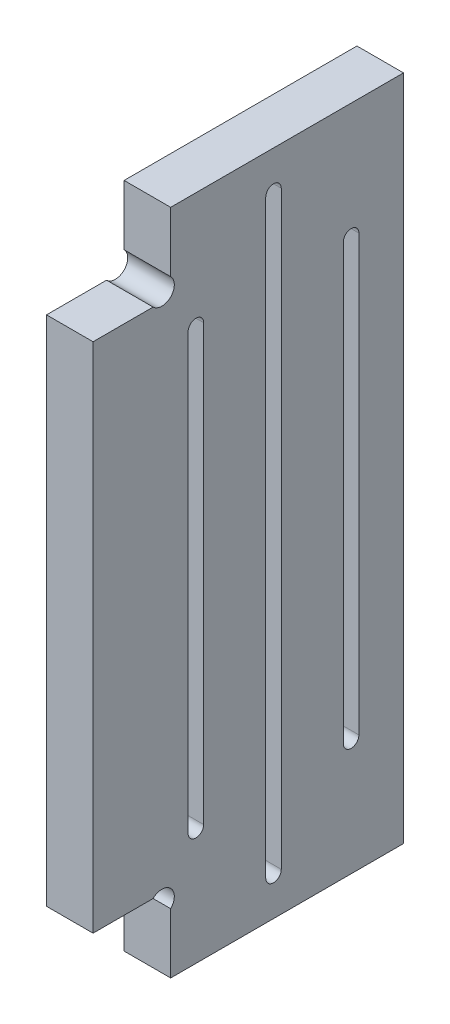
ISO-10303-21;
HEADER;
FILE_DESCRIPTION(('STEP AP214'),'2;1');
FILE_NAME('part.step','',(''),(''),'','','');
FILE_SCHEMA(('AUTOMOTIVE_DESIGN { 1 0 10303 214 1 1 1 1 }'));
ENDSEC;
DATA;
#1=APPLICATION_CONTEXT('core data for automotive mechanical design processes');
#2=APPLICATION_PROTOCOL_DEFINITION('international standard','automotive_design',2000,#1);
#3=PRODUCT_CONTEXT('',#1,'mechanical');
#4=PRODUCT('Part','Part','',(#3));
#5=PRODUCT_RELATED_PRODUCT_CATEGORY('part','',(#4));
#6=PRODUCT_DEFINITION_FORMATION('','',#4);
#7=PRODUCT_DEFINITION_CONTEXT('part definition',#1,'design');
#8=PRODUCT_DEFINITION('design','',#6,#7);
#9=PRODUCT_DEFINITION_SHAPE('','',#8);
#10=(LENGTH_UNIT() NAMED_UNIT(*) SI_UNIT(.MILLI.,.METRE.));
#11=(NAMED_UNIT(*) PLANE_ANGLE_UNIT() SI_UNIT($,.RADIAN.));
#12=(NAMED_UNIT(*) SI_UNIT($,.STERADIAN.) SOLID_ANGLE_UNIT());
#13=UNCERTAINTY_MEASURE_WITH_UNIT(LENGTH_MEASURE(1.E-05),#10,'distance_accuracy_value','');
#14=(GEOMETRIC_REPRESENTATION_CONTEXT(3) GLOBAL_UNCERTAINTY_ASSIGNED_CONTEXT((#13)) GLOBAL_UNIT_ASSIGNED_CONTEXT((#10,
#11,#12)) REPRESENTATION_CONTEXT('',''));
#15=CARTESIAN_POINT('',(0.,0.,0.));
#16=DIRECTION('',(0.,0.,1.));
#17=DIRECTION('',(1.,0.,0.));
#18=AXIS2_PLACEMENT_3D('',#15,#16,#17);
#19=CARTESIAN_POINT('',(6.,219.125569004844,-80.));
#20=DIRECTION('',(0.,0.,-1.));
#21=DIRECTION('',(-1.,0.,0.));
#22=AXIS2_PLACEMENT_3D('',#19,#20,#21);
#23=PLANE('',#22);
#24=DIRECTION('',(0.,-1.,0.));
#25=VECTOR('',#24,1.);
#26=CARTESIAN_POINT('',(0.,219.125569004844,-80.));
#27=LINE('',#26,#25);
#28=CARTESIAN_POINT('',(0.,226.862827305047,-80.));
#29=VERTEX_POINT('',#28);
#30=CARTESIAN_POINT('',(0.,219.125569004844,-80.));
#31=VERTEX_POINT('',#30);
#32=EDGE_CURVE('E218',#29,#31,#27,.T.);
#33=ORIENTED_EDGE('',*,*,#32,.T.);
#34=DIRECTION('',(-1.,0.,0.));
#35=VECTOR('',#34,1.);
#36=CARTESIAN_POINT('',(6.,219.125569004844,-80.));
#37=LINE('',#36,#35);
#38=CARTESIAN_POINT('',(6.,219.125569004844,-80.));
#39=VERTEX_POINT('',#38);
#40=EDGE_CURVE('E11',#39,#31,#37,.T.);
#41=ORIENTED_EDGE('',*,*,#40,.F.);
#42=DIRECTION('',(0.,-1.,0.));
#43=VECTOR('',#42,1.);
#44=CARTESIAN_POINT('',(6.,219.125569004844,-80.));
#45=LINE('',#44,#43);
#46=CARTESIAN_POINT('',(6.,226.862827305047,-80.));
#47=VERTEX_POINT('',#46);
#48=EDGE_CURVE('E283',#47,#39,#45,.T.);
#49=ORIENTED_EDGE('',*,*,#48,.F.);
#50=DIRECTION('',(-1.,0.,0.));
#51=VECTOR('',#50,1.);
#52=CARTESIAN_POINT('',(6.,226.862827305047,-80.));
#53=LINE('',#52,#51);
#54=EDGE_CURVE('E305',#47,#29,#53,.T.);
#55=ORIENTED_EDGE('',*,*,#54,.T.);
#56=EDGE_LOOP('',(#33,#41,#49,#55));
#57=FACE_BOUND('',#56,.T.);
#58=ADVANCED_FACE('F32',(#57),#23,.F.);
#59=CARTESIAN_POINT('',(6.,217.994198154946,-78.8686291501015));
#60=DIRECTION('',(-1.,0.,0.));
#61=DIRECTION('',(0.,0.,1.));
#62=AXIS2_PLACEMENT_3D('',#59,#60,#61);
#63=CYLINDRICAL_SURFACE('',#62,1.6);
#64=CARTESIAN_POINT('',(0.,217.994198154946,-78.8686291501015));
#65=DIRECTION('',(-1.,0.,0.));
#66=DIRECTION('',(0.,0.,1.));
#67=AXIS2_PLACEMENT_3D('',#64,#65,#66);
#68=CIRCLE('',#67,1.6);
#69=CARTESIAN_POINT('',(0.,216.862827305047,-77.737258300203));
#70=VERTEX_POINT('',#69);
#71=EDGE_CURVE('E308',#31,#70,#68,.T.);
#72=ORIENTED_EDGE('',*,*,#71,.T.);
#73=DIRECTION('',(-1.,0.,0.));
#74=VECTOR('',#73,1.);
#75=CARTESIAN_POINT('',(6.,216.862827305047,-77.737258300203));
#76=LINE('',#75,#74);
#77=CARTESIAN_POINT('',(6.,216.862827305047,-77.737258300203));
#78=VERTEX_POINT('',#77);
#79=EDGE_CURVE('E39',#78,#70,#76,.T.);
#80=ORIENTED_EDGE('',*,*,#79,.F.);
#81=CARTESIAN_POINT('',(6.,217.994198154946,-78.8686291501015));
#82=DIRECTION('',(-1.,0.,0.));
#83=DIRECTION('',(0.,0.,1.));
#84=AXIS2_PLACEMENT_3D('',#81,#82,#83);
#85=CIRCLE('',#84,1.6);
#86=EDGE_CURVE('E286',#39,#78,#85,.T.);
#87=ORIENTED_EDGE('',*,*,#86,.F.);
#88=ORIENTED_EDGE('',*,*,#40,.T.);
#89=EDGE_LOOP('',(#72,#80,#87,#88));
#90=FACE_BOUND('',#89,.T.);
#91=ADVANCED_FACE('F374',(#90),#63,.F.);
#92=CARTESIAN_POINT('',(6.,216.862827305047,-77.737258300203));
#93=DIRECTION('',(0.,-1.,0.));
#94=DIRECTION('',(0.,0.,-1.));
#95=AXIS2_PLACEMENT_3D('',#92,#93,#94);
#96=PLANE('',#95);
#97=DIRECTION('',(0.,0.,1.));
#98=VECTOR('',#97,1.);
#99=CARTESIAN_POINT('',(0.,216.862827305047,-77.737258300203));
#100=LINE('',#99,#98);
#101=CARTESIAN_POINT('',(0.,216.862827305047,-70.));
#102=VERTEX_POINT('',#101);
#103=EDGE_CURVE('E310',#70,#102,#100,.T.);
#104=ORIENTED_EDGE('',*,*,#103,.T.);
#105=DIRECTION('',(-1.,0.,0.));
#106=VECTOR('',#105,1.);
#107=CARTESIAN_POINT('',(6.,216.862827305047,-70.));
#108=LINE('',#107,#106);
#109=CARTESIAN_POINT('',(6.,216.862827305047,-70.));
#110=VERTEX_POINT('',#109);
#111=EDGE_CURVE('E345',#110,#102,#108,.T.);
#112=ORIENTED_EDGE('',*,*,#111,.F.);
#113=DIRECTION('',(0.,0.,1.));
#114=VECTOR('',#113,1.);
#115=CARTESIAN_POINT('',(6.,216.862827305047,-77.737258300203));
#116=LINE('',#115,#114);
#117=EDGE_CURVE('E289',#78,#110,#116,.T.);
#118=ORIENTED_EDGE('',*,*,#117,.F.);
#119=ORIENTED_EDGE('',*,*,#79,.T.);
#120=EDGE_LOOP('',(#104,#112,#118,#119));
#121=FACE_BOUND('',#120,.T.);
#122=ADVANCED_FACE('F352',(#121),#96,.F.);
#123=CARTESIAN_POINT('',(6.,150.862827305047,-70.));
#124=DIRECTION('',(0.,0.,-1.));
#125=DIRECTION('',(-1.,0.,0.));
#126=AXIS2_PLACEMENT_3D('',#123,#124,#125);
#127=PLANE('',#126);
#128=DIRECTION('',(0.,-1.,0.));
#129=VECTOR('',#128,1.);
#130=CARTESIAN_POINT('',(0.,150.862827305047,-70.));
#131=LINE('',#130,#129);
#132=CARTESIAN_POINT('',(0.,150.862827305047,-70.));
#133=VERTEX_POINT('',#132);
#134=EDGE_CURVE('E312',#102,#133,#131,.T.);
#135=ORIENTED_EDGE('',*,*,#134,.T.);
#136=DIRECTION('',(-1.,0.,0.));
#137=VECTOR('',#136,1.);
#138=CARTESIAN_POINT('',(6.,150.862827305047,-70.));
#139=LINE('',#138,#137);
#140=CARTESIAN_POINT('',(6.,150.862827305047,-70.));
#141=VERTEX_POINT('',#140);
#142=EDGE_CURVE('E342',#141,#133,#139,.T.);
#143=ORIENTED_EDGE('',*,*,#142,.F.);
#144=DIRECTION('',(0.,-1.,0.));
#145=VECTOR('',#144,1.);
#146=CARTESIAN_POINT('',(6.,150.862827305047,-70.));
#147=LINE('',#146,#145);
#148=EDGE_CURVE('E291',#110,#141,#147,.T.);
#149=ORIENTED_EDGE('',*,*,#148,.F.);
#150=ORIENTED_EDGE('',*,*,#111,.T.);
#151=EDGE_LOOP('',(#135,#143,#149,#150));
#152=FACE_BOUND('',#151,.T.);
#153=ADVANCED_FACE('F363',(#152),#127,.F.);
#154=CARTESIAN_POINT('',(6.,150.862827305047,-77.737258300203));
#155=DIRECTION('',(0.,1.,0.));
#156=DIRECTION('',(0.,0.,1.));
#157=AXIS2_PLACEMENT_3D('',#154,#155,#156);
#158=PLANE('',#157);
#159=DIRECTION('',(0.,0.,-1.));
#160=VECTOR('',#159,1.);
#161=CARTESIAN_POINT('',(0.,150.862827305047,-77.737258300203));
#162=LINE('',#161,#160);
#163=CARTESIAN_POINT('',(0.,150.862827305047,-77.737258300203));
#164=VERTEX_POINT('',#163);
#165=EDGE_CURVE('E314',#133,#164,#162,.T.);
#166=ORIENTED_EDGE('',*,*,#165,.T.);
#167=DIRECTION('',(-1.,0.,0.));
#168=VECTOR('',#167,1.);
#169=CARTESIAN_POINT('',(6.,150.862827305047,-77.737258300203));
#170=LINE('',#169,#168);
#171=CARTESIAN_POINT('',(6.,150.862827305047,-77.737258300203));
#172=VERTEX_POINT('',#171);
#173=EDGE_CURVE('E339',#172,#164,#170,.T.);
#174=ORIENTED_EDGE('',*,*,#173,.F.);
#175=DIRECTION('',(0.,0.,-1.));
#176=VECTOR('',#175,1.);
#177=CARTESIAN_POINT('',(6.,150.862827305047,-77.737258300203));
#178=LINE('',#177,#176);
#179=EDGE_CURVE('E293',#141,#172,#178,.T.);
#180=ORIENTED_EDGE('',*,*,#179,.F.);
#181=ORIENTED_EDGE('',*,*,#142,.T.);
#182=EDGE_LOOP('',(#166,#174,#180,#181));
#183=FACE_BOUND('',#182,.T.);
#184=ADVANCED_FACE('F367',(#183),#158,.F.);
#185=CARTESIAN_POINT('',(6.,149.731456455149,-78.8686291501015));
#186=DIRECTION('',(-1.,0.,0.));
#187=DIRECTION('',(0.,0.,1.));
#188=AXIS2_PLACEMENT_3D('',#185,#186,#187);
#189=CYLINDRICAL_SURFACE('',#188,1.6);
#190=CARTESIAN_POINT('',(0.,149.731456455149,-78.8686291501015));
#191=DIRECTION('',(-1.,0.,0.));
#192=DIRECTION('',(0.,0.,-1.));
#193=AXIS2_PLACEMENT_3D('',#190,#191,#192);
#194=CIRCLE('',#193,1.6);
#195=CARTESIAN_POINT('',(0.,148.60008560525,-80.));
#196=VERTEX_POINT('',#195);
#197=EDGE_CURVE('E316',#164,#196,#194,.T.);
#198=ORIENTED_EDGE('',*,*,#197,.T.);
#199=DIRECTION('',(-1.,0.,0.));
#200=VECTOR('',#199,1.);
#201=CARTESIAN_POINT('',(6.,148.60008560525,-80.));
#202=LINE('',#201,#200);
#203=CARTESIAN_POINT('',(6.,148.60008560525,-80.));
#204=VERTEX_POINT('',#203);
#205=EDGE_CURVE('E336',#204,#196,#202,.T.);
#206=ORIENTED_EDGE('',*,*,#205,.F.);
#207=CARTESIAN_POINT('',(6.,149.731456455149,-78.8686291501015));
#208=DIRECTION('',(-1.,0.,0.));
#209=DIRECTION('',(0.,0.,-1.));
#210=AXIS2_PLACEMENT_3D('',#207,#208,#209);
#211=CIRCLE('',#210,1.6);
#212=EDGE_CURVE('E295',#172,#204,#211,.T.);
#213=ORIENTED_EDGE('',*,*,#212,.F.);
#214=ORIENTED_EDGE('',*,*,#173,.T.);
#215=EDGE_LOOP('',(#198,#206,#213,#214));
#216=FACE_BOUND('',#215,.T.);
#217=ADVANCED_FACE('F397',(#216),#189,.F.);
#218=CARTESIAN_POINT('',(6.,140.862827305047,-80.));
#219=DIRECTION('',(0.,0.,-1.));
#220=DIRECTION('',(0.,1.,0.));
#221=AXIS2_PLACEMENT_3D('',#218,#219,#220);
#222=PLANE('',#221);
#223=DIRECTION('',(0.,-1.,0.));
#224=VECTOR('',#223,1.);
#225=CARTESIAN_POINT('',(0.,140.862827305047,-80.));
#226=LINE('',#225,#224);
#227=CARTESIAN_POINT('',(0.,140.862827305047,-80.));
#228=VERTEX_POINT('',#227);
#229=EDGE_CURVE('E318',#196,#228,#226,.T.);
#230=ORIENTED_EDGE('',*,*,#229,.T.);
#231=DIRECTION('',(-1.,0.,0.));
#232=VECTOR('',#231,1.);
#233=CARTESIAN_POINT('',(6.,140.862827305047,-80.));
#234=LINE('',#233,#232);
#235=CARTESIAN_POINT('',(6.,140.862827305047,-80.));
#236=VERTEX_POINT('',#235);
#237=EDGE_CURVE('E333',#236,#228,#234,.T.);
#238=ORIENTED_EDGE('',*,*,#237,.F.);
#239=DIRECTION('',(0.,-1.,0.));
#240=VECTOR('',#239,1.);
#241=CARTESIAN_POINT('',(6.,140.862827305047,-80.));
#242=LINE('',#241,#240);
#243=EDGE_CURVE('E297',#204,#236,#242,.T.);
#244=ORIENTED_EDGE('',*,*,#243,.F.);
#245=ORIENTED_EDGE('',*,*,#205,.T.);
#246=EDGE_LOOP('',(#230,#238,#244,#245));
#247=FACE_BOUND('',#246,.T.);
#248=ADVANCED_FACE('F394',(#247),#222,.F.);
#249=CARTESIAN_POINT('',(6.,140.862827305047,-80.));
#250=DIRECTION('',(0.,1.,0.));
#251=DIRECTION('',(0.,0.,1.));
#252=AXIS2_PLACEMENT_3D('',#249,#250,#251);
#253=PLANE('',#252);
#254=DIRECTION('',(0.,0.,-1.));
#255=VECTOR('',#254,1.);
#256=CARTESIAN_POINT('',(0.,140.862827305047,-80.));
#257=LINE('',#256,#255);
#258=CARTESIAN_POINT('',(0.,140.862827305047,-110.));
#259=VERTEX_POINT('',#258);
#260=EDGE_CURVE('E320',#228,#259,#257,.T.);
#261=ORIENTED_EDGE('',*,*,#260,.T.);
#262=DIRECTION('',(-1.,0.,0.));
#263=VECTOR('',#262,1.);
#264=CARTESIAN_POINT('',(6.,140.862827305047,-110.));
#265=LINE('',#264,#263);
#266=CARTESIAN_POINT('',(6.,140.862827305047,-110.));
#267=VERTEX_POINT('',#266);
#268=EDGE_CURVE('E330',#267,#259,#265,.T.);
#269=ORIENTED_EDGE('',*,*,#268,.F.);
#270=DIRECTION('',(0.,0.,-1.));
#271=VECTOR('',#270,1.);
#272=CARTESIAN_POINT('',(6.,140.862827305047,-80.));
#273=LINE('',#272,#271);
#274=EDGE_CURVE('E299',#236,#267,#273,.T.);
#275=ORIENTED_EDGE('',*,*,#274,.F.);
#276=ORIENTED_EDGE('',*,*,#237,.T.);
#277=EDGE_LOOP('',(#261,#269,#275,#276));
#278=FACE_BOUND('',#277,.T.);
#279=ADVANCED_FACE('F390',(#278),#253,.F.);
#280=CARTESIAN_POINT('',(6.,140.862827305047,-110.));
#281=DIRECTION('',(0.,0.,1.));
#282=DIRECTION('',(1.,0.,0.));
#283=AXIS2_PLACEMENT_3D('',#280,#281,#282);
#284=PLANE('',#283);
#285=DIRECTION('',(0.,1.,0.));
#286=VECTOR('',#285,1.);
#287=CARTESIAN_POINT('',(0.,140.862827305047,-110.));
#288=LINE('',#287,#286);
#289=CARTESIAN_POINT('',(0.,226.862827305047,-110.));
#290=VERTEX_POINT('',#289);
#291=EDGE_CURVE('E322',#259,#290,#288,.T.);
#292=ORIENTED_EDGE('',*,*,#291,.T.);
#293=DIRECTION('',(-1.,0.,0.));
#294=VECTOR('',#293,1.);
#295=CARTESIAN_POINT('',(6.,226.862827305047,-110.));
#296=LINE('',#295,#294);
#297=CARTESIAN_POINT('',(6.,226.862827305047,-110.));
#298=VERTEX_POINT('',#297);
#299=EDGE_CURVE('E327',#298,#290,#296,.T.);
#300=ORIENTED_EDGE('',*,*,#299,.F.);
#301=DIRECTION('',(0.,1.,0.));
#302=VECTOR('',#301,1.);
#303=CARTESIAN_POINT('',(6.,140.862827305047,-110.));
#304=LINE('',#303,#302);
#305=EDGE_CURVE('E301',#267,#298,#304,.T.);
#306=ORIENTED_EDGE('',*,*,#305,.F.);
#307=ORIENTED_EDGE('',*,*,#268,.T.);
#308=EDGE_LOOP('',(#292,#300,#306,#307));
#309=FACE_BOUND('',#308,.T.);
#310=ADVANCED_FACE('F386',(#309),#284,.F.);
#311=CARTESIAN_POINT('',(6.,226.862827305047,-110.));
#312=DIRECTION('',(0.,-1.,0.));
#313=DIRECTION('',(0.,0.,-1.));
#314=AXIS2_PLACEMENT_3D('',#311,#312,#313);
#315=PLANE('',#314);
#316=DIRECTION('',(0.,0.,1.));
#317=VECTOR('',#316,1.);
#318=CARTESIAN_POINT('',(0.,226.862827305047,-110.));
#319=LINE('',#318,#317);
#320=EDGE_CURVE('E287',#290,#29,#319,.T.);
#321=ORIENTED_EDGE('',*,*,#320,.T.);
#322=ORIENTED_EDGE('',*,*,#54,.F.);
#323=DIRECTION('',(0.,0.,1.));
#324=VECTOR('',#323,1.);
#325=CARTESIAN_POINT('',(6.,226.862827305047,-110.));
#326=LINE('',#325,#324);
#327=EDGE_CURVE('E303',#298,#47,#326,.T.);
#328=ORIENTED_EDGE('',*,*,#327,.F.);
#329=ORIENTED_EDGE('',*,*,#299,.T.);
#330=EDGE_LOOP('',(#321,#322,#328,#329));
#331=FACE_BOUND('',#330,.T.);
#332=ADVANCED_FACE('F381',(#331),#315,.F.);
#333=CARTESIAN_POINT('',(6.,149.731456455149,-78.8686291501015));
#334=DIRECTION('',(1.,0.,0.));
#335=DIRECTION('',(0.,0.,-1.));
#336=AXIS2_PLACEMENT_3D('',#333,#334,#335);
#337=PLANE('',#336);
#338=CARTESIAN_POINT('',(6.,155.862827305047,-83.25));
#339=DIRECTION('',(-1.,0.,0.));
#340=DIRECTION('',(0.,0.,1.));
#341=AXIS2_PLACEMENT_3D('',#338,#339,#340);
#342=CIRCLE('',#341,1.);
#343=CARTESIAN_POINT('',(6.,155.862827305047,-84.25));
#344=VERTEX_POINT('',#343);
#345=CARTESIAN_POINT('',(6.,155.862827305047,-82.25));
#346=VERTEX_POINT('',#345);
#347=EDGE_CURVE('E184',#344,#346,#342,.T.);
#348=ORIENTED_EDGE('',*,*,#347,.T.);
#349=DIRECTION('',(0.,1.,0.));
#350=VECTOR('',#349,1.);
#351=CARTESIAN_POINT('',(6.,155.862827305047,-82.25));
#352=LINE('',#351,#350);
#353=CARTESIAN_POINT('',(6.,211.862827305047,-82.25));
#354=VERTEX_POINT('',#353);
#355=EDGE_CURVE('E195',#346,#354,#352,.T.);
#356=ORIENTED_EDGE('',*,*,#355,.T.);
#357=CARTESIAN_POINT('',(6.,211.862827305047,-83.25));
#358=DIRECTION('',(-1.,0.,0.));
#359=DIRECTION('',(0.,0.,1.));
#360=AXIS2_PLACEMENT_3D('',#357,#358,#359);
#361=CIRCLE('',#360,0.999999999999987);
#362=CARTESIAN_POINT('',(6.,211.862827305047,-84.25));
#363=VERTEX_POINT('',#362);
#364=EDGE_CURVE('E46',#354,#363,#361,.T.);
#365=ORIENTED_EDGE('',*,*,#364,.T.);
#366=DIRECTION('',(0.,-1.,0.));
#367=VECTOR('',#366,1.);
#368=CARTESIAN_POINT('',(6.,155.862827305047,-84.25));
#369=LINE('',#368,#367);
#370=EDGE_CURVE('E192',#363,#344,#369,.T.);
#371=ORIENTED_EDGE('',*,*,#370,.T.);
#372=EDGE_LOOP('',(#348,#356,#365,#371));
#373=FACE_BOUND('',#372,.T.);
#374=CARTESIAN_POINT('',(6.,145.862827305047,-93.25));
#375=DIRECTION('',(-1.,0.,0.));
#376=DIRECTION('',(0.,0.,1.));
#377=AXIS2_PLACEMENT_3D('',#374,#375,#376);
#378=CIRCLE('',#377,1.);
#379=CARTESIAN_POINT('',(6.,145.862827305047,-94.25));
#380=VERTEX_POINT('',#379);
#381=CARTESIAN_POINT('',(6.,145.862827305047,-92.25));
#382=VERTEX_POINT('',#381);
#383=EDGE_CURVE('E222',#380,#382,#378,.T.);
#384=ORIENTED_EDGE('',*,*,#383,.T.);
#385=DIRECTION('',(0.,1.,0.));
#386=VECTOR('',#385,1.);
#387=CARTESIAN_POINT('',(6.,145.862827305047,-92.25));
#388=LINE('',#387,#386);
#389=CARTESIAN_POINT('',(6.,221.862827305047,-92.25));
#390=VERTEX_POINT('',#389);
#391=EDGE_CURVE('E225',#382,#390,#388,.T.);
#392=ORIENTED_EDGE('',*,*,#391,.T.);
#393=CARTESIAN_POINT('',(6.,221.862827305047,-93.25));
#394=DIRECTION('',(-1.,0.,0.));
#395=DIRECTION('',(0.,0.,1.));
#396=AXIS2_PLACEMENT_3D('',#393,#394,#395);
#397=CIRCLE('',#396,1.);
#398=CARTESIAN_POINT('',(6.,221.862827305047,-94.25));
#399=VERTEX_POINT('',#398);
#400=EDGE_CURVE('E54',#390,#399,#397,.T.);
#401=ORIENTED_EDGE('',*,*,#400,.T.);
#402=DIRECTION('',(0.,-1.,0.));
#403=VECTOR('',#402,1.);
#404=CARTESIAN_POINT('',(6.,145.862827305047,-94.25));
#405=LINE('',#404,#403);
#406=EDGE_CURVE('E230',#399,#380,#405,.T.);
#407=ORIENTED_EDGE('',*,*,#406,.T.);
#408=EDGE_LOOP('',(#384,#392,#401,#407));
#409=FACE_BOUND('',#408,.T.);
#410=CARTESIAN_POINT('',(6.,155.862827305047,-103.25));
#411=DIRECTION('',(-1.,0.,0.));
#412=DIRECTION('',(0.,0.,1.));
#413=AXIS2_PLACEMENT_3D('',#410,#411,#412);
#414=CIRCLE('',#413,1.);
#415=CARTESIAN_POINT('',(6.,155.862827305047,-104.25));
#416=VERTEX_POINT('',#415);
#417=CARTESIAN_POINT('',(6.,155.862827305047,-102.25));
#418=VERTEX_POINT('',#417);
#419=EDGE_CURVE('E252',#416,#418,#414,.T.);
#420=ORIENTED_EDGE('',*,*,#419,.T.);
#421=DIRECTION('',(0.,1.,0.));
#422=VECTOR('',#421,1.);
#423=CARTESIAN_POINT('',(6.,155.862827305047,-102.25));
#424=LINE('',#423,#422);
#425=CARTESIAN_POINT('',(6.,211.862827305047,-102.25));
#426=VERTEX_POINT('',#425);
#427=EDGE_CURVE('E255',#418,#426,#424,.T.);
#428=ORIENTED_EDGE('',*,*,#427,.T.);
#429=CARTESIAN_POINT('',(6.,211.862827305047,-103.25));
#430=DIRECTION('',(-1.,0.,0.));
#431=DIRECTION('',(0.,0.,1.));
#432=AXIS2_PLACEMENT_3D('',#429,#430,#431);
#433=CIRCLE('',#432,1.);
#434=CARTESIAN_POINT('',(6.,211.862827305047,-104.25));
#435=VERTEX_POINT('',#434);
#436=EDGE_CURVE('E259',#426,#435,#433,.T.);
#437=ORIENTED_EDGE('',*,*,#436,.T.);
#438=DIRECTION('',(0.,-1.,0.));
#439=VECTOR('',#438,1.);
#440=CARTESIAN_POINT('',(6.,155.862827305047,-104.25));
#441=LINE('',#440,#439);
#442=EDGE_CURVE('E262',#435,#416,#441,.T.);
#443=ORIENTED_EDGE('',*,*,#442,.T.);
#444=EDGE_LOOP('',(#420,#428,#437,#443));
#445=FACE_BOUND('',#444,.T.);
#446=ORIENTED_EDGE('',*,*,#48,.T.);
#447=ORIENTED_EDGE('',*,*,#86,.T.);
#448=ORIENTED_EDGE('',*,*,#117,.T.);
#449=ORIENTED_EDGE('',*,*,#148,.T.);
#450=ORIENTED_EDGE('',*,*,#179,.T.);
#451=ORIENTED_EDGE('',*,*,#212,.T.);
#452=ORIENTED_EDGE('',*,*,#243,.T.);
#453=ORIENTED_EDGE('',*,*,#274,.T.);
#454=ORIENTED_EDGE('',*,*,#305,.T.);
#455=ORIENTED_EDGE('',*,*,#327,.T.);
#456=EDGE_LOOP('',(#446,#447,#448,#449,#450,#451,#452,#453,#454,#455));
#457=FACE_BOUND('',#456,.T.);
#458=ADVANCED_FACE('F199',(#373,#409,#445,#457),#337,.T.);
#459=CARTESIAN_POINT('',(0.,149.731456455149,-78.8686291501015));
#460=DIRECTION('',(1.,0.,0.));
#461=DIRECTION('',(0.,0.,-1.));
#462=AXIS2_PLACEMENT_3D('',#459,#460,#461);
#463=PLANE('',#462);
#464=DIRECTION('',(0.,1.,0.));
#465=VECTOR('',#464,1.);
#466=CARTESIAN_POINT('',(0.,155.862827305047,-82.25));
#467=LINE('',#466,#465);
#468=CARTESIAN_POINT('',(0.,155.862827305047,-82.25));
#469=VERTEX_POINT('',#468);
#470=CARTESIAN_POINT('',(0.,211.862827305047,-82.25));
#471=VERTEX_POINT('',#470);
#472=EDGE_CURVE('E211',#469,#471,#467,.T.);
#473=ORIENTED_EDGE('',*,*,#472,.F.);
#474=CARTESIAN_POINT('',(0.,155.862827305047,-83.25));
#475=DIRECTION('',(-1.,0.,0.));
#476=DIRECTION('',(0.,0.,1.));
#477=AXIS2_PLACEMENT_3D('',#474,#475,#476);
#478=CIRCLE('',#477,1.);
#479=CARTESIAN_POINT('',(0.,155.862827305047,-84.25));
#480=VERTEX_POINT('',#479);
#481=EDGE_CURVE('E187',#480,#469,#478,.T.);
#482=ORIENTED_EDGE('',*,*,#481,.F.);
#483=DIRECTION('',(0.,-1.,0.));
#484=VECTOR('',#483,1.);
#485=CARTESIAN_POINT('',(0.,155.862827305047,-84.25));
#486=LINE('',#485,#484);
#487=CARTESIAN_POINT('',(0.,211.862827305047,-84.25));
#488=VERTEX_POINT('',#487);
#489=EDGE_CURVE('E202',#488,#480,#486,.T.);
#490=ORIENTED_EDGE('',*,*,#489,.F.);
#491=CARTESIAN_POINT('',(0.,211.862827305047,-83.25));
#492=DIRECTION('',(-1.,0.,0.));
#493=DIRECTION('',(0.,0.,1.));
#494=AXIS2_PLACEMENT_3D('',#491,#492,#493);
#495=CIRCLE('',#494,0.999999999999987);
#496=EDGE_CURVE('E205',#471,#488,#495,.T.);
#497=ORIENTED_EDGE('',*,*,#496,.F.);
#498=EDGE_LOOP('',(#473,#482,#490,#497));
#499=FACE_BOUND('',#498,.T.);
#500=DIRECTION('',(0.,1.,0.));
#501=VECTOR('',#500,1.);
#502=CARTESIAN_POINT('',(0.,145.862827305047,-92.25));
#503=LINE('',#502,#501);
#504=CARTESIAN_POINT('',(0.,145.862827305047,-92.25));
#505=VERTEX_POINT('',#504);
#506=CARTESIAN_POINT('',(0.,221.862827305047,-92.25));
#507=VERTEX_POINT('',#506);
#508=EDGE_CURVE('E236',#505,#507,#503,.T.);
#509=ORIENTED_EDGE('',*,*,#508,.F.);
#510=CARTESIAN_POINT('',(0.,145.862827305047,-93.25));
#511=DIRECTION('',(-1.,0.,0.));
#512=DIRECTION('',(0.,0.,1.));
#513=AXIS2_PLACEMENT_3D('',#510,#511,#512);
#514=CIRCLE('',#513,1.);
#515=CARTESIAN_POINT('',(0.,145.862827305047,-94.25));
#516=VERTEX_POINT('',#515);
#517=EDGE_CURVE('E234',#516,#505,#514,.T.);
#518=ORIENTED_EDGE('',*,*,#517,.F.);
#519=DIRECTION('',(0.,-1.,0.));
#520=VECTOR('',#519,1.);
#521=CARTESIAN_POINT('',(0.,145.862827305047,-94.25));
#522=LINE('',#521,#520);
#523=CARTESIAN_POINT('',(0.,221.862827305047,-94.25));
#524=VERTEX_POINT('',#523);
#525=EDGE_CURVE('E226',#524,#516,#522,.T.);
#526=ORIENTED_EDGE('',*,*,#525,.F.);
#527=CARTESIAN_POINT('',(0.,221.862827305047,-93.25));
#528=DIRECTION('',(-1.,0.,0.));
#529=DIRECTION('',(0.,0.,1.));
#530=AXIS2_PLACEMENT_3D('',#527,#528,#529);
#531=CIRCLE('',#530,1.);
#532=EDGE_CURVE('E240',#507,#524,#531,.T.);
#533=ORIENTED_EDGE('',*,*,#532,.F.);
#534=EDGE_LOOP('',(#509,#518,#526,#533));
#535=FACE_BOUND('',#534,.T.);
#536=DIRECTION('',(0.,1.,0.));
#537=VECTOR('',#536,1.);
#538=CARTESIAN_POINT('',(0.,155.862827305047,-102.25));
#539=LINE('',#538,#537);
#540=CARTESIAN_POINT('',(0.,155.862827305047,-102.25));
#541=VERTEX_POINT('',#540);
#542=CARTESIAN_POINT('',(0.,211.862827305047,-102.25));
#543=VERTEX_POINT('',#542);
#544=EDGE_CURVE('E268',#541,#543,#539,.T.);
#545=ORIENTED_EDGE('',*,*,#544,.F.);
#546=CARTESIAN_POINT('',(0.,155.862827305047,-103.25));
#547=DIRECTION('',(-1.,0.,0.));
#548=DIRECTION('',(0.,0.,1.));
#549=AXIS2_PLACEMENT_3D('',#546,#547,#548);
#550=CIRCLE('',#549,1.);
#551=CARTESIAN_POINT('',(0.,155.862827305047,-104.25));
#552=VERTEX_POINT('',#551);
#553=EDGE_CURVE('E266',#552,#541,#550,.T.);
#554=ORIENTED_EDGE('',*,*,#553,.F.);
#555=DIRECTION('',(0.,-1.,0.));
#556=VECTOR('',#555,1.);
#557=CARTESIAN_POINT('',(0.,155.862827305047,-104.25));
#558=LINE('',#557,#556);
#559=CARTESIAN_POINT('',(0.,211.862827305047,-104.25));
#560=VERTEX_POINT('',#559);
#561=EDGE_CURVE('E256',#560,#552,#558,.T.);
#562=ORIENTED_EDGE('',*,*,#561,.F.);
#563=CARTESIAN_POINT('',(0.,211.862827305047,-103.25));
#564=DIRECTION('',(-1.,0.,0.));
#565=DIRECTION('',(0.,0.,1.));
#566=AXIS2_PLACEMENT_3D('',#563,#564,#565);
#567=CIRCLE('',#566,1.);
#568=EDGE_CURVE('E271',#543,#560,#567,.T.);
#569=ORIENTED_EDGE('',*,*,#568,.F.);
#570=EDGE_LOOP('',(#545,#554,#562,#569));
#571=FACE_BOUND('',#570,.T.);
#572=ORIENTED_EDGE('',*,*,#32,.F.);
#573=ORIENTED_EDGE('',*,*,#320,.F.);
#574=ORIENTED_EDGE('',*,*,#291,.F.);
#575=ORIENTED_EDGE('',*,*,#260,.F.);
#576=ORIENTED_EDGE('',*,*,#229,.F.);
#577=ORIENTED_EDGE('',*,*,#197,.F.);
#578=ORIENTED_EDGE('',*,*,#165,.F.);
#579=ORIENTED_EDGE('',*,*,#134,.F.);
#580=ORIENTED_EDGE('',*,*,#103,.F.);
#581=ORIENTED_EDGE('',*,*,#71,.F.);
#582=EDGE_LOOP('',(#572,#573,#574,#575,#576,#577,#578,#579,#580,#581));
#583=FACE_BOUND('',#582,.T.);
#584=ADVANCED_FACE('F358',(#499,#535,#571,#583),#463,.F.);
#585=CARTESIAN_POINT('',(6.,155.862827305047,-103.25));
#586=DIRECTION('',(-1.,0.,0.));
#587=DIRECTION('',(0.,0.,1.));
#588=AXIS2_PLACEMENT_3D('',#585,#586,#587);
#589=CYLINDRICAL_SURFACE('',#588,1.);
#590=ORIENTED_EDGE('',*,*,#553,.T.);
#591=DIRECTION('',(-1.,0.,0.));
#592=VECTOR('',#591,1.);
#593=CARTESIAN_POINT('',(6.,155.862827305047,-102.25));
#594=LINE('',#593,#592);
#595=EDGE_CURVE('E265',#418,#541,#594,.T.);
#596=ORIENTED_EDGE('',*,*,#595,.F.);
#597=ORIENTED_EDGE('',*,*,#419,.F.);
#598=DIRECTION('',(-1.,0.,0.));
#599=VECTOR('',#598,1.);
#600=CARTESIAN_POINT('',(6.,155.862827305047,-104.25));
#601=LINE('',#600,#599);
#602=EDGE_CURVE('E237',#416,#552,#601,.T.);
#603=ORIENTED_EDGE('',*,*,#602,.T.);
#604=EDGE_LOOP('',(#590,#596,#597,#603));
#605=FACE_BOUND('',#604,.T.);
#606=ADVANCED_FACE('F475',(#605),#589,.F.);
#607=CARTESIAN_POINT('',(6.,155.862827305047,-104.25));
#608=DIRECTION('',(0.,0.,-1.));
#609=DIRECTION('',(-1.,0.,0.));
#610=AXIS2_PLACEMENT_3D('',#607,#608,#609);
#611=PLANE('',#610);
#612=ORIENTED_EDGE('',*,*,#561,.T.);
#613=ORIENTED_EDGE('',*,*,#602,.F.);
#614=ORIENTED_EDGE('',*,*,#442,.F.);
#615=DIRECTION('',(-1.,0.,0.));
#616=VECTOR('',#615,1.);
#617=CARTESIAN_POINT('',(6.,211.862827305047,-104.25));
#618=LINE('',#617,#616);
#619=EDGE_CURVE('E277',#435,#560,#618,.T.);
#620=ORIENTED_EDGE('',*,*,#619,.T.);
#621=EDGE_LOOP('',(#612,#613,#614,#620));
#622=FACE_BOUND('',#621,.T.);
#623=ADVANCED_FACE('F485',(#622),#611,.F.);
#624=CARTESIAN_POINT('',(6.,211.862827305047,-103.25));
#625=DIRECTION('',(-1.,0.,0.));
#626=DIRECTION('',(0.,0.,1.));
#627=AXIS2_PLACEMENT_3D('',#624,#625,#626);
#628=CYLINDRICAL_SURFACE('',#627,1.);
#629=ORIENTED_EDGE('',*,*,#568,.T.);
#630=ORIENTED_EDGE('',*,*,#619,.F.);
#631=ORIENTED_EDGE('',*,*,#436,.F.);
#632=DIRECTION('',(-1.,0.,0.));
#633=VECTOR('',#632,1.);
#634=CARTESIAN_POINT('',(6.,211.862827305047,-102.25));
#635=LINE('',#634,#633);
#636=EDGE_CURVE('E279',#426,#543,#635,.T.);
#637=ORIENTED_EDGE('',*,*,#636,.T.);
#638=EDGE_LOOP('',(#629,#630,#631,#637));
#639=FACE_BOUND('',#638,.T.);
#640=ADVANCED_FACE('F495',(#639),#628,.F.);
#641=CARTESIAN_POINT('',(6.,155.862827305047,-102.25));
#642=DIRECTION('',(0.,0.,1.));
#643=DIRECTION('',(1.,0.,0.));
#644=AXIS2_PLACEMENT_3D('',#641,#642,#643);
#645=PLANE('',#644);
#646=ORIENTED_EDGE('',*,*,#544,.T.);
#647=ORIENTED_EDGE('',*,*,#636,.F.);
#648=ORIENTED_EDGE('',*,*,#427,.F.);
#649=ORIENTED_EDGE('',*,*,#595,.T.);
#650=EDGE_LOOP('',(#646,#647,#648,#649));
#651=FACE_BOUND('',#650,.T.);
#652=ADVANCED_FACE('F505',(#651),#645,.F.);
#653=CARTESIAN_POINT('',(6.,145.862827305047,-93.25));
#654=DIRECTION('',(-1.,0.,0.));
#655=DIRECTION('',(0.,0.,1.));
#656=AXIS2_PLACEMENT_3D('',#653,#654,#655);
#657=CYLINDRICAL_SURFACE('',#656,1.);
#658=ORIENTED_EDGE('',*,*,#517,.T.);
#659=DIRECTION('',(-1.,0.,0.));
#660=VECTOR('',#659,1.);
#661=CARTESIAN_POINT('',(6.,145.862827305047,-92.25));
#662=LINE('',#661,#660);
#663=EDGE_CURVE('E233',#382,#505,#662,.T.);
#664=ORIENTED_EDGE('',*,*,#663,.F.);
#665=ORIENTED_EDGE('',*,*,#383,.F.);
#666=DIRECTION('',(-1.,0.,0.));
#667=VECTOR('',#666,1.);
#668=CARTESIAN_POINT('',(6.,145.862827305047,-94.25));
#669=LINE('',#668,#667);
#670=EDGE_CURVE('E212',#380,#516,#669,.T.);
#671=ORIENTED_EDGE('',*,*,#670,.T.);
#672=EDGE_LOOP('',(#658,#664,#665,#671));
#673=FACE_BOUND('',#672,.T.);
#674=ADVANCED_FACE('F515',(#673),#657,.F.);
#675=CARTESIAN_POINT('',(6.,145.862827305047,-94.25));
#676=DIRECTION('',(0.,0.,-1.));
#677=DIRECTION('',(-1.,0.,0.));
#678=AXIS2_PLACEMENT_3D('',#675,#676,#677);
#679=PLANE('',#678);
#680=ORIENTED_EDGE('',*,*,#525,.T.);
#681=ORIENTED_EDGE('',*,*,#670,.F.);
#682=ORIENTED_EDGE('',*,*,#406,.F.);
#683=DIRECTION('',(-1.,0.,0.));
#684=VECTOR('',#683,1.);
#685=CARTESIAN_POINT('',(6.,221.862827305047,-94.25));
#686=LINE('',#685,#684);
#687=EDGE_CURVE('E246',#399,#524,#686,.T.);
#688=ORIENTED_EDGE('',*,*,#687,.T.);
#689=EDGE_LOOP('',(#680,#681,#682,#688));
#690=FACE_BOUND('',#689,.T.);
#691=ADVANCED_FACE('F525',(#690),#679,.F.);
#692=CARTESIAN_POINT('',(6.,221.862827305047,-93.25));
#693=DIRECTION('',(-1.,0.,0.));
#694=DIRECTION('',(0.,0.,1.));
#695=AXIS2_PLACEMENT_3D('',#692,#693,#694);
#696=CYLINDRICAL_SURFACE('',#695,1.);
#697=ORIENTED_EDGE('',*,*,#532,.T.);
#698=ORIENTED_EDGE('',*,*,#687,.F.);
#699=ORIENTED_EDGE('',*,*,#400,.F.);
#700=DIRECTION('',(-1.,0.,0.));
#701=VECTOR('',#700,1.);
#702=CARTESIAN_POINT('',(6.,221.862827305047,-92.25));
#703=LINE('',#702,#701);
#704=EDGE_CURVE('E248',#390,#507,#703,.T.);
#705=ORIENTED_EDGE('',*,*,#704,.T.);
#706=EDGE_LOOP('',(#697,#698,#699,#705));
#707=FACE_BOUND('',#706,.T.);
#708=ADVANCED_FACE('F535',(#707),#696,.F.);
#709=CARTESIAN_POINT('',(6.,145.862827305047,-92.25));
#710=DIRECTION('',(0.,0.,1.));
#711=DIRECTION('',(1.,0.,0.));
#712=AXIS2_PLACEMENT_3D('',#709,#710,#711);
#713=PLANE('',#712);
#714=ORIENTED_EDGE('',*,*,#508,.T.);
#715=ORIENTED_EDGE('',*,*,#704,.F.);
#716=ORIENTED_EDGE('',*,*,#391,.F.);
#717=ORIENTED_EDGE('',*,*,#663,.T.);
#718=EDGE_LOOP('',(#714,#715,#716,#717));
#719=FACE_BOUND('',#718,.T.);
#720=ADVANCED_FACE('F545',(#719),#713,.F.);
#721=CARTESIAN_POINT('',(6.,155.862827305047,-83.25));
#722=DIRECTION('',(-1.,0.,0.));
#723=DIRECTION('',(0.,0.,1.));
#724=AXIS2_PLACEMENT_3D('',#721,#722,#723);
#725=CYLINDRICAL_SURFACE('',#724,1.);
#726=ORIENTED_EDGE('',*,*,#481,.T.);
#727=DIRECTION('',(-1.,0.,0.));
#728=VECTOR('',#727,1.);
#729=CARTESIAN_POINT('',(6.,155.862827305047,-82.25));
#730=LINE('',#729,#728);
#731=EDGE_CURVE('E180',#346,#469,#730,.T.);
#732=ORIENTED_EDGE('',*,*,#731,.F.);
#733=ORIENTED_EDGE('',*,*,#347,.F.);
#734=DIRECTION('',(-1.,0.,0.));
#735=VECTOR('',#734,1.);
#736=CARTESIAN_POINT('',(6.,155.862827305047,-84.25));
#737=LINE('',#736,#735);
#738=EDGE_CURVE('E216',#344,#480,#737,.T.);
#739=ORIENTED_EDGE('',*,*,#738,.T.);
#740=EDGE_LOOP('',(#726,#732,#733,#739));
#741=FACE_BOUND('',#740,.T.);
#742=ADVANCED_FACE('F182',(#741),#725,.F.);
#743=CARTESIAN_POINT('',(6.,155.862827305047,-84.25));
#744=DIRECTION('',(0.,0.,-1.));
#745=DIRECTION('',(0.,1.,0.));
#746=AXIS2_PLACEMENT_3D('',#743,#744,#745);
#747=PLANE('',#746);
#748=ORIENTED_EDGE('',*,*,#489,.T.);
#749=ORIENTED_EDGE('',*,*,#738,.F.);
#750=ORIENTED_EDGE('',*,*,#370,.F.);
#751=DIRECTION('',(-1.,0.,0.));
#752=VECTOR('',#751,1.);
#753=CARTESIAN_POINT('',(6.,211.862827305047,-84.25));
#754=LINE('',#753,#752);
#755=EDGE_CURVE('E219',#363,#488,#754,.T.);
#756=ORIENTED_EDGE('',*,*,#755,.T.);
#757=EDGE_LOOP('',(#748,#749,#750,#756));
#758=FACE_BOUND('',#757,.T.);
#759=ADVANCED_FACE('F563',(#758),#747,.F.);
#760=CARTESIAN_POINT('',(6.,211.862827305047,-83.25));
#761=DIRECTION('',(-1.,0.,0.));
#762=DIRECTION('',(0.,0.,1.));
#763=AXIS2_PLACEMENT_3D('',#760,#761,#762);
#764=CYLINDRICAL_SURFACE('',#763,0.999999999999987);
#765=ORIENTED_EDGE('',*,*,#496,.T.);
#766=ORIENTED_EDGE('',*,*,#755,.F.);
#767=ORIENTED_EDGE('',*,*,#364,.F.);
#768=DIRECTION('',(-1.,0.,0.));
#769=VECTOR('',#768,1.);
#770=CARTESIAN_POINT('',(6.,211.862827305047,-82.25));
#771=LINE('',#770,#769);
#772=EDGE_CURVE('E191',#354,#471,#771,.T.);
#773=ORIENTED_EDGE('',*,*,#772,.T.);
#774=EDGE_LOOP('',(#765,#766,#767,#773));
#775=FACE_BOUND('',#774,.T.);
#776=ADVANCED_FACE('F572',(#775),#764,.F.);
#777=CARTESIAN_POINT('',(6.,155.862827305047,-82.25));
#778=DIRECTION('',(0.,0.,1.));
#779=DIRECTION('',(0.,-1.,0.));
#780=AXIS2_PLACEMENT_3D('',#777,#778,#779);
#781=PLANE('',#780);
#782=ORIENTED_EDGE('',*,*,#472,.T.);
#783=ORIENTED_EDGE('',*,*,#772,.F.);
#784=ORIENTED_EDGE('',*,*,#355,.F.);
#785=ORIENTED_EDGE('',*,*,#731,.T.);
#786=EDGE_LOOP('',(#782,#783,#784,#785));
#787=FACE_BOUND('',#786,.T.);
#788=ADVANCED_FACE('F196',(#787),#781,.F.);
#789=CLOSED_SHELL('',(#58,#91,#122,#153,#184,#217,#248,#279,#310,#332,#458,#584,#606,#623,#640,
#652,#674,#691,#708,#720,#742,#759,#776,#788));
#790=MANIFOLD_SOLID_BREP('B2',#789);
#791=ADVANCED_BREP_SHAPE_REPRESENTATION('',(#18,#790),#14);
#792=SHAPE_DEFINITION_REPRESENTATION(#9,#791);
ENDSEC;
END-ISO-10303-21;
